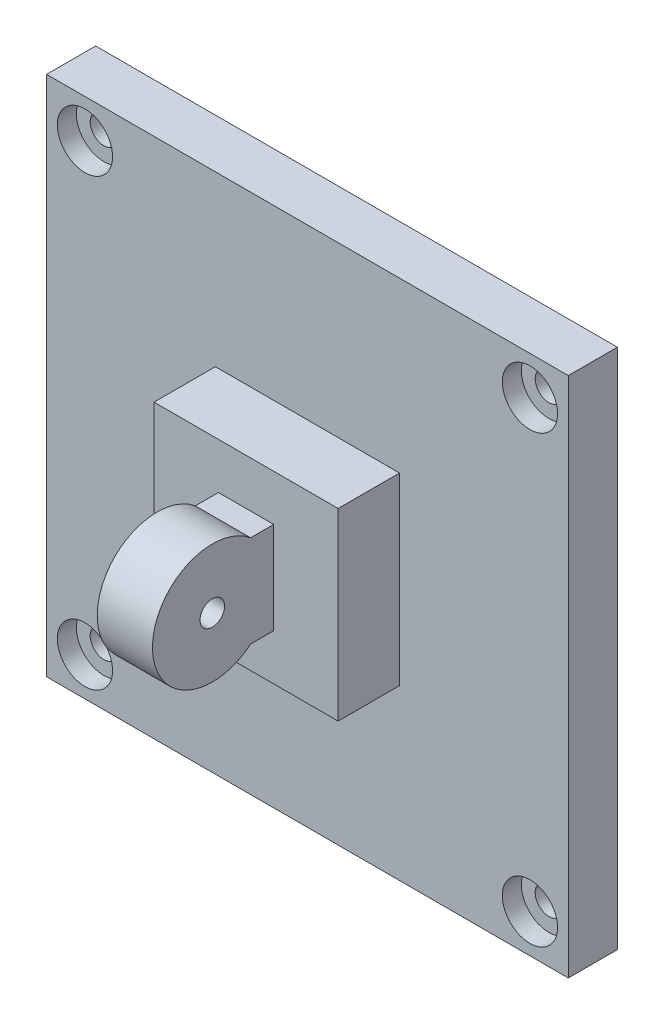
ISO-10303-21;
HEADER;
FILE_DESCRIPTION(('STEP AP214'),'2;1');
FILE_NAME('part.step','',(''),(''),'','','');
FILE_SCHEMA(('AUTOMOTIVE_DESIGN { 1 0 10303 214 1 1 1 1 }'));
ENDSEC;
DATA;
#1=APPLICATION_CONTEXT('core data for automotive mechanical design processes');
#2=APPLICATION_PROTOCOL_DEFINITION('international standard','automotive_design',2000,#1);
#3=PRODUCT_CONTEXT('',#1,'mechanical');
#4=PRODUCT('Part','Part','',(#3));
#5=PRODUCT_RELATED_PRODUCT_CATEGORY('part','',(#4));
#6=PRODUCT_DEFINITION_FORMATION('','',#4);
#7=PRODUCT_DEFINITION_CONTEXT('part definition',#1,'design');
#8=PRODUCT_DEFINITION('design','',#6,#7);
#9=PRODUCT_DEFINITION_SHAPE('','',#8);
#10=(LENGTH_UNIT() NAMED_UNIT(*) SI_UNIT(.MILLI.,.METRE.));
#11=(NAMED_UNIT(*) PLANE_ANGLE_UNIT() SI_UNIT($,.RADIAN.));
#12=(NAMED_UNIT(*) SI_UNIT($,.STERADIAN.) SOLID_ANGLE_UNIT());
#13=UNCERTAINTY_MEASURE_WITH_UNIT(LENGTH_MEASURE(1.E-05),#10,'distance_accuracy_value','');
#14=(GEOMETRIC_REPRESENTATION_CONTEXT(3) GLOBAL_UNCERTAINTY_ASSIGNED_CONTEXT((#13)) GLOBAL_UNIT_ASSIGNED_CONTEXT((#10,
#11,#12)) REPRESENTATION_CONTEXT('',''));
#15=CARTESIAN_POINT('',(0.,0.,0.));
#16=DIRECTION('',(0.,0.,1.));
#17=DIRECTION('',(1.,0.,0.));
#18=AXIS2_PLACEMENT_3D('',#15,#16,#17);
#19=CARTESIAN_POINT('',(42.5,-10.,18.));
#20=DIRECTION('',(0.,0.,-1.));
#21=DIRECTION('',(-1.,0.,0.));
#22=AXIS2_PLACEMENT_3D('',#19,#20,#21);
#23=PLANE('',#22);
#24=DIRECTION('',(-1.,0.,0.));
#25=VECTOR('',#24,1.);
#26=CARTESIAN_POINT('',(42.5,15.,18.));
#27=LINE('',#26,#25);
#28=CARTESIAN_POINT('',(15.,15.,18.));
#29=VERTEX_POINT('',#28);
#30=CARTESIAN_POINT('',(-15.,15.,18.));
#31=VERTEX_POINT('',#30);
#32=EDGE_CURVE('E153',#29,#31,#27,.T.);
#33=ORIENTED_EDGE('',*,*,#32,.T.);
#34=DIRECTION('',(0.,-1.,0.));
#35=VECTOR('',#34,1.);
#36=CARTESIAN_POINT('',(-15.,-10.,18.));
#37=LINE('',#36,#35);
#38=CARTESIAN_POINT('',(-15.,-15.,18.));
#39=VERTEX_POINT('',#38);
#40=EDGE_CURVE('E151',#31,#39,#37,.T.);
#41=ORIENTED_EDGE('',*,*,#40,.T.);
#42=DIRECTION('',(-1.,0.,0.));
#43=VECTOR('',#42,1.);
#44=CARTESIAN_POINT('',(42.5,-15.,18.));
#45=LINE('',#44,#43);
#46=CARTESIAN_POINT('',(15.,-15.,18.));
#47=VERTEX_POINT('',#46);
#48=EDGE_CURVE('E154',#47,#39,#45,.T.);
#49=ORIENTED_EDGE('',*,*,#48,.F.);
#50=DIRECTION('',(0.,-1.,0.));
#51=VECTOR('',#50,1.);
#52=CARTESIAN_POINT('',(15.,15.,18.));
#53=LINE('',#52,#51);
#54=EDGE_CURVE('E157',#29,#47,#53,.T.);
#55=ORIENTED_EDGE('',*,*,#54,.F.);
#56=EDGE_LOOP('',(#33,#41,#49,#55));
#57=FACE_BOUND('',#56,.T.);
#58=DIRECTION('',(0.,-1.,0.));
#59=VECTOR('',#58,1.);
#60=CARTESIAN_POINT('',(-4.5,7.5,18.));
#61=LINE('',#60,#59);
#62=CARTESIAN_POINT('',(-4.5,7.5,18.));
#63=VERTEX_POINT('',#62);
#64=CARTESIAN_POINT('',(-4.5,-7.5,18.));
#65=VERTEX_POINT('',#64);
#66=EDGE_CURVE('E141',#63,#65,#61,.T.);
#67=ORIENTED_EDGE('',*,*,#66,.F.);
#68=DIRECTION('',(-1.,0.,0.));
#69=VECTOR('',#68,1.);
#70=CARTESIAN_POINT('',(-4.5,7.5,18.));
#71=LINE('',#70,#69);
#72=CARTESIAN_POINT('',(4.5,7.5,18.));
#73=VERTEX_POINT('',#72);
#74=EDGE_CURVE('E138',#73,#63,#71,.T.);
#75=ORIENTED_EDGE('',*,*,#74,.F.);
#76=DIRECTION('',(0.,1.,0.));
#77=VECTOR('',#76,1.);
#78=CARTESIAN_POINT('',(4.5,7.5,18.));
#79=LINE('',#78,#77);
#80=CARTESIAN_POINT('',(4.5,-7.5,18.));
#81=VERTEX_POINT('',#80);
#82=EDGE_CURVE('E125',#81,#73,#79,.T.);
#83=ORIENTED_EDGE('',*,*,#82,.F.);
#84=DIRECTION('',(1.,0.,0.));
#85=VECTOR('',#84,1.);
#86=CARTESIAN_POINT('',(-4.5,-7.5,18.));
#87=LINE('',#86,#85);
#88=EDGE_CURVE('E135',#65,#81,#87,.T.);
#89=ORIENTED_EDGE('',*,*,#88,.F.);
#90=EDGE_LOOP('',(#67,#75,#83,#89));
#91=FACE_BOUND('',#90,.T.);
#92=ADVANCED_FACE('F35',(#57,#91),#23,.F.);
#93=CARTESIAN_POINT('',(0.,0.,8.));
#94=DIRECTION('',(0.,0.,1.));
#95=DIRECTION('',(1.,0.,0.));
#96=AXIS2_PLACEMENT_3D('',#93,#94,#95);
#97=PLANE('',#96);
#98=CARTESIAN_POINT('',(-36.25,36.25,8.));
#99=DIRECTION('',(0.,0.,1.));
#100=DIRECTION('',(1.,0.,0.));
#101=AXIS2_PLACEMENT_3D('',#98,#99,#100);
#102=CIRCLE('',#101,4.5);
#103=CARTESIAN_POINT('',(-31.75,36.25,8.));
#104=VERTEX_POINT('',#103);
#105=EDGE_CURVE('E181',#104,#104,#102,.T.);
#106=ORIENTED_EDGE('',*,*,#105,.F.);
#107=EDGE_LOOP('',(#106));
#108=FACE_BOUND('',#107,.T.);
#109=CARTESIAN_POINT('',(-36.25,-36.25,8.));
#110=DIRECTION('',(0.,0.,1.));
#111=DIRECTION('',(1.,0.,0.));
#112=AXIS2_PLACEMENT_3D('',#109,#110,#111);
#113=CIRCLE('',#112,4.5);
#114=CARTESIAN_POINT('',(-31.75,-36.25,8.));
#115=VERTEX_POINT('',#114);
#116=EDGE_CURVE('E193',#115,#115,#113,.T.);
#117=ORIENTED_EDGE('',*,*,#116,.F.);
#118=EDGE_LOOP('',(#117));
#119=FACE_BOUND('',#118,.T.);
#120=CARTESIAN_POINT('',(36.25,-36.25,8.));
#121=DIRECTION('',(0.,0.,1.));
#122=DIRECTION('',(1.,0.,0.));
#123=AXIS2_PLACEMENT_3D('',#120,#121,#122);
#124=CIRCLE('',#123,4.5);
#125=CARTESIAN_POINT('',(40.75,-36.25,8.));
#126=VERTEX_POINT('',#125);
#127=EDGE_CURVE('E205',#126,#126,#124,.T.);
#128=ORIENTED_EDGE('',*,*,#127,.F.);
#129=EDGE_LOOP('',(#128));
#130=FACE_BOUND('',#129,.T.);
#131=CARTESIAN_POINT('',(36.25,36.25,8.));
#132=DIRECTION('',(0.,0.,1.));
#133=DIRECTION('',(1.,0.,0.));
#134=AXIS2_PLACEMENT_3D('',#131,#132,#133);
#135=CIRCLE('',#134,4.5);
#136=CARTESIAN_POINT('',(40.75,36.25,8.));
#137=VERTEX_POINT('',#136);
#138=EDGE_CURVE('E217',#137,#137,#135,.T.);
#139=ORIENTED_EDGE('',*,*,#138,.F.);
#140=EDGE_LOOP('',(#139));
#141=FACE_BOUND('',#140,.T.);
#142=DIRECTION('',(0.,-1.,0.));
#143=VECTOR('',#142,1.);
#144=CARTESIAN_POINT('',(-42.5,42.5,8.));
#145=LINE('',#144,#143);
#146=CARTESIAN_POINT('',(-42.5,42.5,8.));
#147=VERTEX_POINT('',#146);
#148=CARTESIAN_POINT('',(-42.5,-42.5,8.));
#149=VERTEX_POINT('',#148);
#150=EDGE_CURVE('E230',#147,#149,#145,.T.);
#151=ORIENTED_EDGE('',*,*,#150,.T.);
#152=DIRECTION('',(1.,0.,0.));
#153=VECTOR('',#152,1.);
#154=CARTESIAN_POINT('',(-42.5,-42.5,8.));
#155=LINE('',#154,#153);
#156=CARTESIAN_POINT('',(42.5,-42.5,8.));
#157=VERTEX_POINT('',#156);
#158=EDGE_CURVE('E233',#149,#157,#155,.T.);
#159=ORIENTED_EDGE('',*,*,#158,.T.);
#160=DIRECTION('',(0.,1.,0.));
#161=VECTOR('',#160,1.);
#162=CARTESIAN_POINT('',(42.5,42.5,8.));
#163=LINE('',#162,#161);
#164=CARTESIAN_POINT('',(42.5,42.5,8.));
#165=VERTEX_POINT('',#164);
#166=EDGE_CURVE('E236',#157,#165,#163,.T.);
#167=ORIENTED_EDGE('',*,*,#166,.T.);
#168=DIRECTION('',(-1.,0.,0.));
#169=VECTOR('',#168,1.);
#170=CARTESIAN_POINT('',(-42.5,42.5,8.));
#171=LINE('',#170,#169);
#172=EDGE_CURVE('E238',#165,#147,#171,.T.);
#173=ORIENTED_EDGE('',*,*,#172,.T.);
#174=EDGE_LOOP('',(#151,#159,#167,#173));
#175=FACE_BOUND('',#174,.T.);
#176=DIRECTION('',(1.,0.,0.));
#177=VECTOR('',#176,1.);
#178=CARTESIAN_POINT('',(-15.,-15.,8.));
#179=LINE('',#178,#177);
#180=CARTESIAN_POINT('',(-15.,-15.,8.));
#181=VERTEX_POINT('',#180);
#182=CARTESIAN_POINT('',(15.,-15.,8.));
#183=VERTEX_POINT('',#182);
#184=EDGE_CURVE('E164',#181,#183,#179,.T.);
#185=ORIENTED_EDGE('',*,*,#184,.F.);
#186=DIRECTION('',(0.,-1.,0.));
#187=VECTOR('',#186,1.);
#188=CARTESIAN_POINT('',(-15.,15.,8.));
#189=LINE('',#188,#187);
#190=CARTESIAN_POINT('',(-15.,15.,8.));
#191=VERTEX_POINT('',#190);
#192=EDGE_CURVE('E161',#191,#181,#189,.T.);
#193=ORIENTED_EDGE('',*,*,#192,.F.);
#194=DIRECTION('',(-1.,0.,0.));
#195=VECTOR('',#194,1.);
#196=CARTESIAN_POINT('',(-15.,15.,8.));
#197=LINE('',#196,#195);
#198=CARTESIAN_POINT('',(15.,15.,8.));
#199=VERTEX_POINT('',#198);
#200=EDGE_CURVE('E170',#199,#191,#197,.T.);
#201=ORIENTED_EDGE('',*,*,#200,.F.);
#202=DIRECTION('',(0.,1.,0.));
#203=VECTOR('',#202,1.);
#204=CARTESIAN_POINT('',(15.,15.,8.));
#205=LINE('',#204,#203);
#206=EDGE_CURVE('E167',#183,#199,#205,.T.);
#207=ORIENTED_EDGE('',*,*,#206,.F.);
#208=EDGE_LOOP('',(#185,#193,#201,#207));
#209=FACE_BOUND('',#208,.T.);
#210=ADVANCED_FACE('F277',(#108,#119,#130,#141,#175,#209),#97,.T.);
#211=CARTESIAN_POINT('',(-42.5,42.5,8.));
#212=DIRECTION('',(1.,0.,0.));
#213=DIRECTION('',(0.,0.,-1.));
#214=AXIS2_PLACEMENT_3D('',#211,#212,#213);
#215=PLANE('',#214);
#216=DIRECTION('',(0.,-1.,0.));
#217=VECTOR('',#216,1.);
#218=CARTESIAN_POINT('',(-42.5,42.5,0.));
#219=LINE('',#218,#217);
#220=CARTESIAN_POINT('',(-42.5,42.5,0.));
#221=VERTEX_POINT('',#220);
#222=CARTESIAN_POINT('',(-42.5,-42.5,0.));
#223=VERTEX_POINT('',#222);
#224=EDGE_CURVE('E229',#221,#223,#219,.T.);
#225=ORIENTED_EDGE('',*,*,#224,.T.);
#226=DIRECTION('',(0.,0.,-1.));
#227=VECTOR('',#226,1.);
#228=CARTESIAN_POINT('',(-42.5,-42.5,8.));
#229=LINE('',#228,#227);
#230=EDGE_CURVE('E44',#149,#223,#229,.T.);
#231=ORIENTED_EDGE('',*,*,#230,.F.);
#232=ORIENTED_EDGE('',*,*,#150,.F.);
#233=DIRECTION('',(0.,0.,-1.));
#234=VECTOR('',#233,1.);
#235=CARTESIAN_POINT('',(-42.5,42.5,8.));
#236=LINE('',#235,#234);
#237=EDGE_CURVE('E240',#147,#221,#236,.T.);
#238=ORIENTED_EDGE('',*,*,#237,.T.);
#239=EDGE_LOOP('',(#225,#231,#232,#238));
#240=FACE_BOUND('',#239,.T.);
#241=ADVANCED_FACE('F37',(#240),#215,.F.);
#242=CARTESIAN_POINT('',(-42.5,-42.5,8.));
#243=DIRECTION('',(0.,1.,0.));
#244=DIRECTION('',(0.,0.,1.));
#245=AXIS2_PLACEMENT_3D('',#242,#243,#244);
#246=PLANE('',#245);
#247=DIRECTION('',(1.,0.,0.));
#248=VECTOR('',#247,1.);
#249=CARTESIAN_POINT('',(-42.5,-42.5,0.));
#250=LINE('',#249,#248);
#251=CARTESIAN_POINT('',(42.5,-42.5,0.));
#252=VERTEX_POINT('',#251);
#253=EDGE_CURVE('E243',#223,#252,#250,.T.);
#254=ORIENTED_EDGE('',*,*,#253,.T.);
#255=DIRECTION('',(0.,0.,-1.));
#256=VECTOR('',#255,1.);
#257=CARTESIAN_POINT('',(42.5,-42.5,8.));
#258=LINE('',#257,#256);
#259=EDGE_CURVE('E253',#157,#252,#258,.T.);
#260=ORIENTED_EDGE('',*,*,#259,.F.);
#261=ORIENTED_EDGE('',*,*,#158,.F.);
#262=ORIENTED_EDGE('',*,*,#230,.T.);
#263=EDGE_LOOP('',(#254,#260,#261,#262));
#264=FACE_BOUND('',#263,.T.);
#265=ADVANCED_FACE('F259',(#264),#246,.F.);
#266=CARTESIAN_POINT('',(42.5,42.5,8.));
#267=DIRECTION('',(-1.,0.,0.));
#268=DIRECTION('',(0.,-1.,0.));
#269=AXIS2_PLACEMENT_3D('',#266,#267,#268);
#270=PLANE('',#269);
#271=DIRECTION('',(0.,1.,0.));
#272=VECTOR('',#271,1.);
#273=CARTESIAN_POINT('',(42.5,42.5,0.));
#274=LINE('',#273,#272);
#275=CARTESIAN_POINT('',(42.5,42.5,0.));
#276=VERTEX_POINT('',#275);
#277=EDGE_CURVE('E245',#252,#276,#274,.T.);
#278=ORIENTED_EDGE('',*,*,#277,.T.);
#279=DIRECTION('',(0.,0.,-1.));
#280=VECTOR('',#279,1.);
#281=CARTESIAN_POINT('',(42.5,42.5,8.));
#282=LINE('',#281,#280);
#283=EDGE_CURVE('E250',#165,#276,#282,.T.);
#284=ORIENTED_EDGE('',*,*,#283,.F.);
#285=ORIENTED_EDGE('',*,*,#166,.F.);
#286=ORIENTED_EDGE('',*,*,#259,.T.);
#287=EDGE_LOOP('',(#278,#284,#285,#286));
#288=FACE_BOUND('',#287,.T.);
#289=ADVANCED_FACE('F271',(#288),#270,.F.);
#290=CARTESIAN_POINT('',(-42.5,42.5,8.));
#291=DIRECTION('',(0.,-1.,0.));
#292=DIRECTION('',(0.,0.,-1.));
#293=AXIS2_PLACEMENT_3D('',#290,#291,#292);
#294=PLANE('',#293);
#295=DIRECTION('',(-1.,0.,0.));
#296=VECTOR('',#295,1.);
#297=CARTESIAN_POINT('',(-42.5,42.5,0.));
#298=LINE('',#297,#296);
#299=EDGE_CURVE('E234',#276,#221,#298,.T.);
#300=ORIENTED_EDGE('',*,*,#299,.T.);
#301=ORIENTED_EDGE('',*,*,#237,.F.);
#302=ORIENTED_EDGE('',*,*,#172,.F.);
#303=ORIENTED_EDGE('',*,*,#283,.T.);
#304=EDGE_LOOP('',(#300,#301,#302,#303));
#305=FACE_BOUND('',#304,.T.);
#306=ADVANCED_FACE('F275',(#305),#294,.F.);
#307=CARTESIAN_POINT('',(0.,0.,0.));
#308=DIRECTION('',(0.,0.,1.));
#309=DIRECTION('',(1.,0.,0.));
#310=AXIS2_PLACEMENT_3D('',#307,#308,#309);
#311=PLANE('',#310);
#312=CARTESIAN_POINT('',(-36.25,36.25,0.));
#313=DIRECTION('',(0.,0.,1.));
#314=DIRECTION('',(1.,0.,0.));
#315=AXIS2_PLACEMENT_3D('',#312,#313,#314);
#316=CIRCLE('',#315,2.25);
#317=CARTESIAN_POINT('',(-34.,36.25,0.));
#318=VERTEX_POINT('',#317);
#319=EDGE_CURVE('E190',#318,#318,#316,.T.);
#320=ORIENTED_EDGE('',*,*,#319,.T.);
#321=EDGE_LOOP('',(#320));
#322=FACE_BOUND('',#321,.T.);
#323=CARTESIAN_POINT('',(-36.25,-36.25,0.));
#324=DIRECTION('',(0.,0.,1.));
#325=DIRECTION('',(1.,0.,0.));
#326=AXIS2_PLACEMENT_3D('',#323,#324,#325);
#327=CIRCLE('',#326,2.25);
#328=CARTESIAN_POINT('',(-34.,-36.25,0.));
#329=VERTEX_POINT('',#328);
#330=EDGE_CURVE('E202',#329,#329,#327,.T.);
#331=ORIENTED_EDGE('',*,*,#330,.T.);
#332=EDGE_LOOP('',(#331));
#333=FACE_BOUND('',#332,.T.);
#334=CARTESIAN_POINT('',(36.25,-36.25,0.));
#335=DIRECTION('',(0.,0.,1.));
#336=DIRECTION('',(1.,0.,0.));
#337=AXIS2_PLACEMENT_3D('',#334,#335,#336);
#338=CIRCLE('',#337,2.25);
#339=CARTESIAN_POINT('',(38.5,-36.25,0.));
#340=VERTEX_POINT('',#339);
#341=EDGE_CURVE('E214',#340,#340,#338,.T.);
#342=ORIENTED_EDGE('',*,*,#341,.T.);
#343=EDGE_LOOP('',(#342));
#344=FACE_BOUND('',#343,.T.);
#345=CARTESIAN_POINT('',(36.25,36.25,0.));
#346=DIRECTION('',(0.,0.,1.));
#347=DIRECTION('',(1.,0.,0.));
#348=AXIS2_PLACEMENT_3D('',#345,#346,#347);
#349=CIRCLE('',#348,2.25);
#350=CARTESIAN_POINT('',(38.5,36.25,0.));
#351=VERTEX_POINT('',#350);
#352=EDGE_CURVE('E226',#351,#351,#349,.T.);
#353=ORIENTED_EDGE('',*,*,#352,.T.);
#354=EDGE_LOOP('',(#353));
#355=FACE_BOUND('',#354,.T.);
#356=ORIENTED_EDGE('',*,*,#224,.F.);
#357=ORIENTED_EDGE('',*,*,#299,.F.);
#358=ORIENTED_EDGE('',*,*,#277,.F.);
#359=ORIENTED_EDGE('',*,*,#253,.F.);
#360=EDGE_LOOP('',(#356,#357,#358,#359));
#361=FACE_BOUND('',#360,.T.);
#362=ADVANCED_FACE('F267',(#322,#333,#344,#355,#361),#311,.F.);
#363=CARTESIAN_POINT('',(36.25,36.25,8.));
#364=DIRECTION('',(0.,0.,1.));
#365=DIRECTION('',(1.,0.,0.));
#366=AXIS2_PLACEMENT_3D('',#363,#364,#365);
#367=CYLINDRICAL_SURFACE('',#366,2.25);
#368=ORIENTED_EDGE('',*,*,#352,.F.);
#369=EDGE_LOOP('',(#368));
#370=FACE_BOUND('',#369,.T.);
#371=CARTESIAN_POINT('',(36.25,36.25,4.9));
#372=DIRECTION('',(0.,0.,1.));
#373=DIRECTION('',(1.,0.,0.));
#374=AXIS2_PLACEMENT_3D('',#371,#372,#373);
#375=CIRCLE('',#374,2.25);
#376=CARTESIAN_POINT('',(38.5,36.25,4.9));
#377=VERTEX_POINT('',#376);
#378=EDGE_CURVE('E223',#377,#377,#375,.T.);
#379=ORIENTED_EDGE('',*,*,#378,.T.);
#380=EDGE_LOOP('',(#379));
#381=FACE_BOUND('',#380,.T.);
#382=ADVANCED_FACE('F360',(#370,#381),#367,.F.);
#383=CARTESIAN_POINT('',(38.5,36.25,4.9));
#384=DIRECTION('',(0.,0.,-1.));
#385=DIRECTION('',(-1.,0.,0.));
#386=AXIS2_PLACEMENT_3D('',#383,#384,#385);
#387=PLANE('',#386);
#388=ORIENTED_EDGE('',*,*,#378,.F.);
#389=EDGE_LOOP('',(#388));
#390=FACE_BOUND('',#389,.T.);
#391=CARTESIAN_POINT('',(36.25,36.25,4.9));
#392=DIRECTION('',(0.,0.,1.));
#393=DIRECTION('',(1.,0.,0.));
#394=AXIS2_PLACEMENT_3D('',#391,#392,#393);
#395=CIRCLE('',#394,4.5);
#396=CARTESIAN_POINT('',(40.75,36.25,4.9));
#397=VERTEX_POINT('',#396);
#398=EDGE_CURVE('E220',#397,#397,#395,.T.);
#399=ORIENTED_EDGE('',*,*,#398,.T.);
#400=EDGE_LOOP('',(#399));
#401=FACE_BOUND('',#400,.T.);
#402=ADVANCED_FACE('F356',(#390,#401),#387,.F.);
#403=CARTESIAN_POINT('',(36.25,36.25,8.));
#404=DIRECTION('',(0.,0.,1.));
#405=DIRECTION('',(1.,0.,0.));
#406=AXIS2_PLACEMENT_3D('',#403,#404,#405);
#407=CYLINDRICAL_SURFACE('',#406,4.5);
#408=ORIENTED_EDGE('',*,*,#398,.F.);
#409=EDGE_LOOP('',(#408));
#410=FACE_BOUND('',#409,.T.);
#411=ORIENTED_EDGE('',*,*,#138,.T.);
#412=EDGE_LOOP('',(#411));
#413=FACE_BOUND('',#412,.T.);
#414=ADVANCED_FACE('F352',(#410,#413),#407,.F.);
#415=CARTESIAN_POINT('',(36.25,-36.25,8.));
#416=DIRECTION('',(0.,0.,1.));
#417=DIRECTION('',(1.,0.,0.));
#418=AXIS2_PLACEMENT_3D('',#415,#416,#417);
#419=CYLINDRICAL_SURFACE('',#418,2.25);
#420=ORIENTED_EDGE('',*,*,#341,.F.);
#421=EDGE_LOOP('',(#420));
#422=FACE_BOUND('',#421,.T.);
#423=CARTESIAN_POINT('',(36.25,-36.25,4.9));
#424=DIRECTION('',(0.,0.,1.));
#425=DIRECTION('',(1.,0.,0.));
#426=AXIS2_PLACEMENT_3D('',#423,#424,#425);
#427=CIRCLE('',#426,2.25);
#428=CARTESIAN_POINT('',(38.5,-36.25,4.9));
#429=VERTEX_POINT('',#428);
#430=EDGE_CURVE('E211',#429,#429,#427,.T.);
#431=ORIENTED_EDGE('',*,*,#430,.T.);
#432=EDGE_LOOP('',(#431));
#433=FACE_BOUND('',#432,.T.);
#434=ADVANCED_FACE('F348',(#422,#433),#419,.F.);
#435=CARTESIAN_POINT('',(38.5,-36.25,4.9));
#436=DIRECTION('',(0.,0.,-1.));
#437=DIRECTION('',(-1.,0.,0.));
#438=AXIS2_PLACEMENT_3D('',#435,#436,#437);
#439=PLANE('',#438);
#440=ORIENTED_EDGE('',*,*,#430,.F.);
#441=EDGE_LOOP('',(#440));
#442=FACE_BOUND('',#441,.T.);
#443=CARTESIAN_POINT('',(36.25,-36.25,4.9));
#444=DIRECTION('',(0.,0.,1.));
#445=DIRECTION('',(1.,0.,0.));
#446=AXIS2_PLACEMENT_3D('',#443,#444,#445);
#447=CIRCLE('',#446,4.5);
#448=CARTESIAN_POINT('',(40.75,-36.25,4.9));
#449=VERTEX_POINT('',#448);
#450=EDGE_CURVE('E208',#449,#449,#447,.T.);
#451=ORIENTED_EDGE('',*,*,#450,.T.);
#452=EDGE_LOOP('',(#451));
#453=FACE_BOUND('',#452,.T.);
#454=ADVANCED_FACE('F344',(#442,#453),#439,.F.);
#455=CARTESIAN_POINT('',(36.25,-36.25,8.));
#456=DIRECTION('',(0.,0.,1.));
#457=DIRECTION('',(1.,0.,0.));
#458=AXIS2_PLACEMENT_3D('',#455,#456,#457);
#459=CYLINDRICAL_SURFACE('',#458,4.5);
#460=ORIENTED_EDGE('',*,*,#450,.F.);
#461=EDGE_LOOP('',(#460));
#462=FACE_BOUND('',#461,.T.);
#463=ORIENTED_EDGE('',*,*,#127,.T.);
#464=EDGE_LOOP('',(#463));
#465=FACE_BOUND('',#464,.T.);
#466=ADVANCED_FACE('F340',(#462,#465),#459,.F.);
#467=CARTESIAN_POINT('',(-36.25,-36.25,8.));
#468=DIRECTION('',(0.,0.,1.));
#469=DIRECTION('',(1.,0.,0.));
#470=AXIS2_PLACEMENT_3D('',#467,#468,#469);
#471=CYLINDRICAL_SURFACE('',#470,2.25);
#472=ORIENTED_EDGE('',*,*,#330,.F.);
#473=EDGE_LOOP('',(#472));
#474=FACE_BOUND('',#473,.T.);
#475=CARTESIAN_POINT('',(-36.25,-36.25,4.9));
#476=DIRECTION('',(0.,0.,1.));
#477=DIRECTION('',(1.,0.,0.));
#478=AXIS2_PLACEMENT_3D('',#475,#476,#477);
#479=CIRCLE('',#478,2.25);
#480=CARTESIAN_POINT('',(-34.,-36.25,4.9));
#481=VERTEX_POINT('',#480);
#482=EDGE_CURVE('E199',#481,#481,#479,.T.);
#483=ORIENTED_EDGE('',*,*,#482,.T.);
#484=EDGE_LOOP('',(#483));
#485=FACE_BOUND('',#484,.T.);
#486=ADVANCED_FACE('F336',(#474,#485),#471,.F.);
#487=CARTESIAN_POINT('',(-34.,-36.25,4.9));
#488=DIRECTION('',(0.,0.,-1.));
#489=DIRECTION('',(-1.,0.,0.));
#490=AXIS2_PLACEMENT_3D('',#487,#488,#489);
#491=PLANE('',#490);
#492=ORIENTED_EDGE('',*,*,#482,.F.);
#493=EDGE_LOOP('',(#492));
#494=FACE_BOUND('',#493,.T.);
#495=CARTESIAN_POINT('',(-36.25,-36.25,4.9));
#496=DIRECTION('',(0.,0.,1.));
#497=DIRECTION('',(1.,0.,0.));
#498=AXIS2_PLACEMENT_3D('',#495,#496,#497);
#499=CIRCLE('',#498,4.5);
#500=CARTESIAN_POINT('',(-31.75,-36.25,4.9));
#501=VERTEX_POINT('',#500);
#502=EDGE_CURVE('E196',#501,#501,#499,.T.);
#503=ORIENTED_EDGE('',*,*,#502,.T.);
#504=EDGE_LOOP('',(#503));
#505=FACE_BOUND('',#504,.T.);
#506=ADVANCED_FACE('F332',(#494,#505),#491,.F.);
#507=CARTESIAN_POINT('',(-36.25,-36.25,8.));
#508=DIRECTION('',(0.,0.,1.));
#509=DIRECTION('',(1.,0.,0.));
#510=AXIS2_PLACEMENT_3D('',#507,#508,#509);
#511=CYLINDRICAL_SURFACE('',#510,4.5);
#512=ORIENTED_EDGE('',*,*,#502,.F.);
#513=EDGE_LOOP('',(#512));
#514=FACE_BOUND('',#513,.T.);
#515=ORIENTED_EDGE('',*,*,#116,.T.);
#516=EDGE_LOOP('',(#515));
#517=FACE_BOUND('',#516,.T.);
#518=ADVANCED_FACE('F328',(#514,#517),#511,.F.);
#519=CARTESIAN_POINT('',(-36.25,36.25,8.));
#520=DIRECTION('',(0.,0.,1.));
#521=DIRECTION('',(1.,0.,0.));
#522=AXIS2_PLACEMENT_3D('',#519,#520,#521);
#523=CYLINDRICAL_SURFACE('',#522,2.25);
#524=ORIENTED_EDGE('',*,*,#319,.F.);
#525=EDGE_LOOP('',(#524));
#526=FACE_BOUND('',#525,.T.);
#527=CARTESIAN_POINT('',(-36.25,36.25,4.9));
#528=DIRECTION('',(0.,0.,1.));
#529=DIRECTION('',(1.,0.,0.));
#530=AXIS2_PLACEMENT_3D('',#527,#528,#529);
#531=CIRCLE('',#530,2.25);
#532=CARTESIAN_POINT('',(-34.,36.25,4.9));
#533=VERTEX_POINT('',#532);
#534=EDGE_CURVE('E187',#533,#533,#531,.T.);
#535=ORIENTED_EDGE('',*,*,#534,.T.);
#536=EDGE_LOOP('',(#535));
#537=FACE_BOUND('',#536,.T.);
#538=ADVANCED_FACE('F324',(#526,#537),#523,.F.);
#539=CARTESIAN_POINT('',(-34.,36.25,4.9));
#540=DIRECTION('',(0.,0.,-1.));
#541=DIRECTION('',(-1.,0.,0.));
#542=AXIS2_PLACEMENT_3D('',#539,#540,#541);
#543=PLANE('',#542);
#544=ORIENTED_EDGE('',*,*,#534,.F.);
#545=EDGE_LOOP('',(#544));
#546=FACE_BOUND('',#545,.T.);
#547=CARTESIAN_POINT('',(-36.25,36.25,4.9));
#548=DIRECTION('',(0.,0.,1.));
#549=DIRECTION('',(1.,0.,0.));
#550=AXIS2_PLACEMENT_3D('',#547,#548,#549);
#551=CIRCLE('',#550,4.5);
#552=CARTESIAN_POINT('',(-31.75,36.25,4.9));
#553=VERTEX_POINT('',#552);
#554=EDGE_CURVE('E184',#553,#553,#551,.T.);
#555=ORIENTED_EDGE('',*,*,#554,.T.);
#556=EDGE_LOOP('',(#555));
#557=FACE_BOUND('',#556,.T.);
#558=ADVANCED_FACE('F320',(#546,#557),#543,.F.);
#559=CARTESIAN_POINT('',(-36.25,36.25,8.));
#560=DIRECTION('',(0.,0.,1.));
#561=DIRECTION('',(1.,0.,0.));
#562=AXIS2_PLACEMENT_3D('',#559,#560,#561);
#563=CYLINDRICAL_SURFACE('',#562,4.5);
#564=ORIENTED_EDGE('',*,*,#554,.F.);
#565=EDGE_LOOP('',(#564));
#566=FACE_BOUND('',#565,.T.);
#567=ORIENTED_EDGE('',*,*,#105,.T.);
#568=EDGE_LOOP('',(#567));
#569=FACE_BOUND('',#568,.T.);
#570=ADVANCED_FACE('F317',(#566,#569),#563,.F.);
#571=CARTESIAN_POINT('',(-15.,15.,28.));
#572=DIRECTION('',(1.,0.,0.));
#573=DIRECTION('',(0.,0.,-1.));
#574=AXIS2_PLACEMENT_3D('',#571,#572,#573);
#575=PLANE('',#574);
#576=DIRECTION('',(0.,0.,-1.));
#577=VECTOR('',#576,1.);
#578=CARTESIAN_POINT('',(-15.,-15.,28.));
#579=LINE('',#578,#577);
#580=EDGE_CURVE('E179',#39,#181,#579,.T.);
#581=ORIENTED_EDGE('',*,*,#580,.F.);
#582=ORIENTED_EDGE('',*,*,#40,.F.);
#583=DIRECTION('',(0.,0.,-1.));
#584=VECTOR('',#583,1.);
#585=CARTESIAN_POINT('',(-15.,15.,28.));
#586=LINE('',#585,#584);
#587=EDGE_CURVE('E173',#31,#191,#586,.T.);
#588=ORIENTED_EDGE('',*,*,#587,.T.);
#589=ORIENTED_EDGE('',*,*,#192,.T.);
#590=EDGE_LOOP('',(#581,#582,#588,#589));
#591=FACE_BOUND('',#590,.T.);
#592=ADVANCED_FACE('F292',(#591),#575,.F.);
#593=CARTESIAN_POINT('',(-15.,-15.,28.));
#594=DIRECTION('',(0.,1.,0.));
#595=DIRECTION('',(0.,0.,1.));
#596=AXIS2_PLACEMENT_3D('',#593,#594,#595);
#597=PLANE('',#596);
#598=DIRECTION('',(0.,0.,-1.));
#599=VECTOR('',#598,1.);
#600=CARTESIAN_POINT('',(15.,-15.,28.));
#601=LINE('',#600,#599);
#602=EDGE_CURVE('E177',#47,#183,#601,.T.);
#603=ORIENTED_EDGE('',*,*,#602,.F.);
#604=ORIENTED_EDGE('',*,*,#48,.T.);
#605=ORIENTED_EDGE('',*,*,#580,.T.);
#606=ORIENTED_EDGE('',*,*,#184,.T.);
#607=EDGE_LOOP('',(#603,#604,#605,#606));
#608=FACE_BOUND('',#607,.T.);
#609=ADVANCED_FACE('F288',(#608),#597,.F.);
#610=CARTESIAN_POINT('',(15.,15.,28.));
#611=DIRECTION('',(-1.,0.,0.));
#612=DIRECTION('',(0.,0.,1.));
#613=AXIS2_PLACEMENT_3D('',#610,#611,#612);
#614=PLANE('',#613);
#615=DIRECTION('',(0.,0.,-1.));
#616=VECTOR('',#615,1.);
#617=CARTESIAN_POINT('',(15.,15.,28.));
#618=LINE('',#617,#616);
#619=EDGE_CURVE('E175',#29,#199,#618,.T.);
#620=ORIENTED_EDGE('',*,*,#619,.F.);
#621=ORIENTED_EDGE('',*,*,#54,.T.);
#622=ORIENTED_EDGE('',*,*,#602,.T.);
#623=ORIENTED_EDGE('',*,*,#206,.T.);
#624=EDGE_LOOP('',(#620,#621,#622,#623));
#625=FACE_BOUND('',#624,.T.);
#626=ADVANCED_FACE('F299',(#625),#614,.F.);
#627=CARTESIAN_POINT('',(-15.,15.,28.));
#628=DIRECTION('',(0.,-1.,0.));
#629=DIRECTION('',(0.,0.,-1.));
#630=AXIS2_PLACEMENT_3D('',#627,#628,#629);
#631=PLANE('',#630);
#632=ORIENTED_EDGE('',*,*,#587,.F.);
#633=ORIENTED_EDGE('',*,*,#32,.F.);
#634=ORIENTED_EDGE('',*,*,#619,.T.);
#635=ORIENTED_EDGE('',*,*,#200,.T.);
#636=EDGE_LOOP('',(#632,#633,#634,#635));
#637=FACE_BOUND('',#636,.T.);
#638=ADVANCED_FACE('F296',(#637),#631,.F.);
#639=CARTESIAN_POINT('',(-4.5,7.5,28.));
#640=DIRECTION('',(1.,0.,0.));
#641=DIRECTION('',(0.,0.,-1.));
#642=AXIS2_PLACEMENT_3D('',#639,#640,#641);
#643=PLANE('',#642);
#644=CARTESIAN_POINT('',(-4.5,0.,28.));
#645=DIRECTION('',(-1.,0.,0.));
#646=DIRECTION('',(0.,0.,1.));
#647=AXIS2_PLACEMENT_3D('',#644,#645,#646);
#648=CIRCLE('',#647,2.00000000000003);
#649=CARTESIAN_POINT('',(-4.5,0.,30.));
#650=VERTEX_POINT('',#649);
#651=EDGE_CURVE('E478',#650,#650,#648,.T.);
#652=ORIENTED_EDGE('',*,*,#651,.F.);
#653=EDGE_LOOP('',(#652));
#654=FACE_BOUND('',#653,.T.);
#655=DIRECTION('',(0.,0.,-1.));
#656=VECTOR('',#655,1.);
#657=CARTESIAN_POINT('',(-4.5,-7.5,28.));
#658=LINE('',#657,#656);
#659=CARTESIAN_POINT('',(-4.5,-7.5,21.7700321028114));
#660=VERTEX_POINT('',#659);
#661=EDGE_CURVE('E128',#660,#65,#658,.T.);
#662=ORIENTED_EDGE('',*,*,#661,.F.);
#663=CARTESIAN_POINT('',(-4.5,0.,28.));
#664=DIRECTION('',(-1.,0.,0.));
#665=DIRECTION('',(0.,0.,1.));
#666=AXIS2_PLACEMENT_3D('',#663,#664,#665);
#667=CIRCLE('',#666,9.75);
#668=CARTESIAN_POINT('',(-4.5,7.5,21.7700321028114));
#669=VERTEX_POINT('',#668);
#670=EDGE_CURVE('E481',#660,#669,#667,.T.);
#671=ORIENTED_EDGE('',*,*,#670,.T.);
#672=DIRECTION('',(0.,0.,-1.));
#673=VECTOR('',#672,1.);
#674=CARTESIAN_POINT('',(-4.5,7.5,28.));
#675=LINE('',#674,#673);
#676=EDGE_CURVE('E147',#669,#63,#675,.T.);
#677=ORIENTED_EDGE('',*,*,#676,.T.);
#678=ORIENTED_EDGE('',*,*,#66,.T.);
#679=EDGE_LOOP('',(#662,#671,#677,#678));
#680=FACE_BOUND('',#679,.T.);
#681=ADVANCED_FACE('F307',(#654,#680),#643,.F.);
#682=CARTESIAN_POINT('',(-4.5,-7.5,28.));
#683=DIRECTION('',(0.,1.,0.));
#684=DIRECTION('',(0.,0.,1.));
#685=AXIS2_PLACEMENT_3D('',#682,#683,#684);
#686=PLANE('',#685);
#687=DIRECTION('',(0.,0.,-1.));
#688=VECTOR('',#687,1.);
#689=CARTESIAN_POINT('',(4.5,-7.5,28.));
#690=LINE('',#689,#688);
#691=CARTESIAN_POINT('',(4.5,-7.5,21.7700321028114));
#692=VERTEX_POINT('',#691);
#693=EDGE_CURVE('E56',#692,#81,#690,.T.);
#694=ORIENTED_EDGE('',*,*,#693,.F.);
#695=DIRECTION('',(-1.,0.,0.));
#696=VECTOR('',#695,1.);
#697=CARTESIAN_POINT('',(4.5,-7.5,21.7700321028114));
#698=LINE('',#697,#696);
#699=EDGE_CURVE('E51',#692,#660,#698,.T.);
#700=ORIENTED_EDGE('',*,*,#699,.T.);
#701=ORIENTED_EDGE('',*,*,#661,.T.);
#702=ORIENTED_EDGE('',*,*,#88,.T.);
#703=EDGE_LOOP('',(#694,#700,#701,#702));
#704=FACE_BOUND('',#703,.T.);
#705=ADVANCED_FACE('F140',(#704),#686,.F.);
#706=CARTESIAN_POINT('',(4.5,7.5,28.));
#707=DIRECTION('',(-1.,0.,0.));
#708=DIRECTION('',(0.,0.,1.));
#709=AXIS2_PLACEMENT_3D('',#706,#707,#708);
#710=PLANE('',#709);
#711=CARTESIAN_POINT('',(4.5,0.,28.));
#712=DIRECTION('',(-1.,0.,0.));
#713=DIRECTION('',(0.,0.,1.));
#714=AXIS2_PLACEMENT_3D('',#711,#712,#713);
#715=CIRCLE('',#714,2.00000000000003);
#716=CARTESIAN_POINT('',(4.5,0.,30.));
#717=VERTEX_POINT('',#716);
#718=EDGE_CURVE('E39',#717,#717,#715,.T.);
#719=ORIENTED_EDGE('',*,*,#718,.T.);
#720=EDGE_LOOP('',(#719));
#721=FACE_BOUND('',#720,.T.);
#722=CARTESIAN_POINT('',(4.5,0.,28.));
#723=DIRECTION('',(-1.,0.,0.));
#724=DIRECTION('',(0.,0.,1.));
#725=AXIS2_PLACEMENT_3D('',#722,#723,#724);
#726=CIRCLE('',#725,9.75);
#727=CARTESIAN_POINT('',(4.5,7.5,21.7700321028114));
#728=VERTEX_POINT('',#727);
#729=EDGE_CURVE('E127',#692,#728,#726,.T.);
#730=ORIENTED_EDGE('',*,*,#729,.F.);
#731=ORIENTED_EDGE('',*,*,#693,.T.);
#732=ORIENTED_EDGE('',*,*,#82,.T.);
#733=DIRECTION('',(0.,0.,-1.));
#734=VECTOR('',#733,1.);
#735=CARTESIAN_POINT('',(4.5,7.5,28.));
#736=LINE('',#735,#734);
#737=EDGE_CURVE('E129',#728,#73,#736,.T.);
#738=ORIENTED_EDGE('',*,*,#737,.F.);
#739=EDGE_LOOP('',(#730,#731,#732,#738));
#740=FACE_BOUND('',#739,.T.);
#741=ADVANCED_FACE('F123',(#721,#740),#710,.F.);
#742=CARTESIAN_POINT('',(-4.5,7.5,28.));
#743=DIRECTION('',(0.,-1.,0.));
#744=DIRECTION('',(0.,0.,-1.));
#745=AXIS2_PLACEMENT_3D('',#742,#743,#744);
#746=PLANE('',#745);
#747=ORIENTED_EDGE('',*,*,#676,.F.);
#748=DIRECTION('',(-1.,0.,0.));
#749=VECTOR('',#748,1.);
#750=CARTESIAN_POINT('',(4.5,7.5,21.7700321028114));
#751=LINE('',#750,#749);
#752=EDGE_CURVE('E11',#669,#728,#751,.F.);
#753=ORIENTED_EDGE('',*,*,#752,.T.);
#754=ORIENTED_EDGE('',*,*,#737,.T.);
#755=ORIENTED_EDGE('',*,*,#74,.T.);
#756=EDGE_LOOP('',(#747,#753,#754,#755));
#757=FACE_BOUND('',#756,.T.);
#758=ADVANCED_FACE('F431',(#757),#746,.F.);
#759=CARTESIAN_POINT('',(4.5,0.,28.));
#760=DIRECTION('',(-1.,0.,0.));
#761=DIRECTION('',(0.,0.,1.));
#762=AXIS2_PLACEMENT_3D('',#759,#760,#761);
#763=CYLINDRICAL_SURFACE('',#762,9.75);
#764=ORIENTED_EDGE('',*,*,#699,.F.);
#765=ORIENTED_EDGE('',*,*,#729,.T.);
#766=ORIENTED_EDGE('',*,*,#752,.F.);
#767=ORIENTED_EDGE('',*,*,#670,.F.);
#768=EDGE_LOOP('',(#764,#765,#766,#767));
#769=FACE_BOUND('',#768,.T.);
#770=ADVANCED_FACE('F436',(#769),#763,.T.);
#771=CARTESIAN_POINT('',(42.5,0.,28.));
#772=DIRECTION('',(-1.,0.,0.));
#773=DIRECTION('',(0.,0.,1.));
#774=AXIS2_PLACEMENT_3D('',#771,#772,#773);
#775=CYLINDRICAL_SURFACE('',#774,2.00000000000003);
#776=ORIENTED_EDGE('',*,*,#651,.T.);
#777=EDGE_LOOP('',(#776));
#778=FACE_BOUND('',#777,.T.);
#779=ORIENTED_EDGE('',*,*,#718,.F.);
#780=EDGE_LOOP('',(#779));
#781=FACE_BOUND('',#780,.T.);
#782=ADVANCED_FACE('F447',(#778,#781),#775,.F.);
#783=CLOSED_SHELL('',(#92,#210,#241,#265,#289,#306,#362,#382,#402,#414,#434,#454,#466,#486,#506,
#518,#538,#558,#570,#592,#609,#626,#638,#681,#705,#741,#758,#770,#782));
#784=MANIFOLD_SOLID_BREP('B2',#783);
#785=ADVANCED_BREP_SHAPE_REPRESENTATION('',(#18,#784),#14);
#786=SHAPE_DEFINITION_REPRESENTATION(#9,#785);
ENDSEC;
END-ISO-10303-21;
